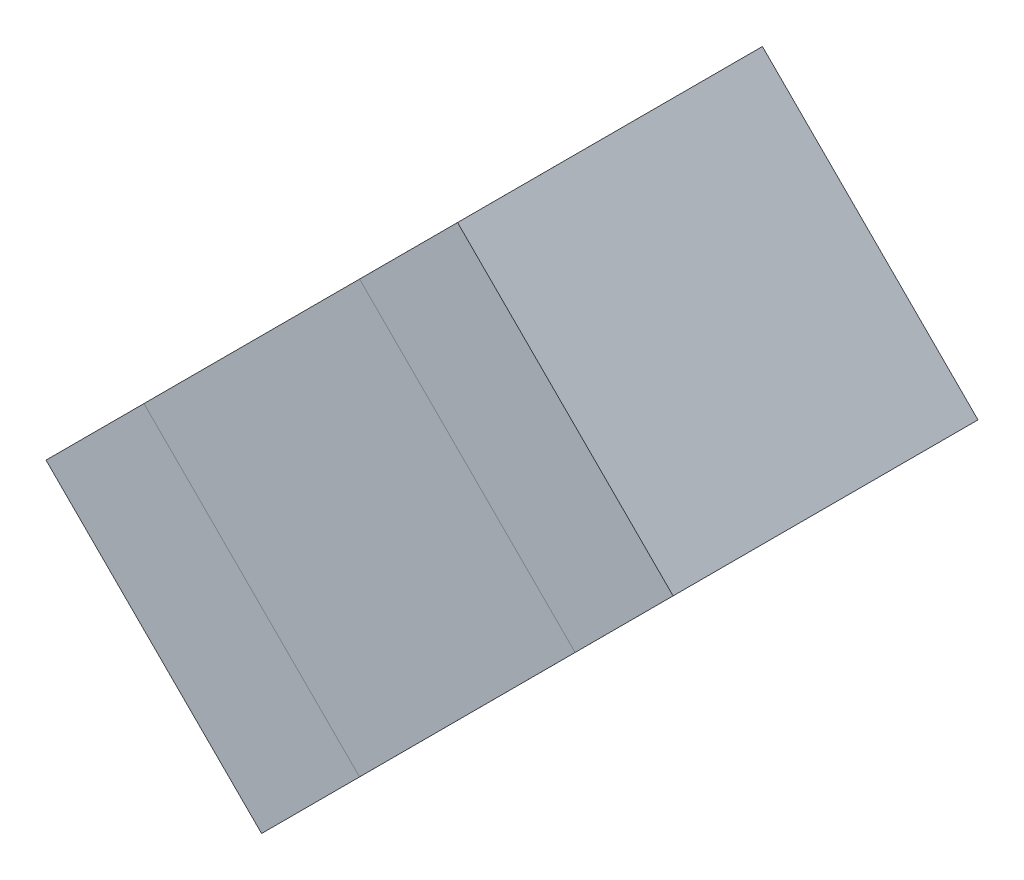
ISO-10303-21;
HEADER;
FILE_DESCRIPTION(('STEP AP214'),'2;1');
FILE_NAME('part.step','',(''),(''),'','','');
FILE_SCHEMA(('AUTOMOTIVE_DESIGN { 1 0 10303 214 1 1 1 1 }'));
ENDSEC;
DATA;
#1=APPLICATION_CONTEXT('core data for automotive mechanical design processes');
#2=APPLICATION_PROTOCOL_DEFINITION('international standard','automotive_design',2000,#1);
#3=PRODUCT_CONTEXT('',#1,'mechanical');
#4=PRODUCT('Part','Part','',(#3));
#5=PRODUCT_RELATED_PRODUCT_CATEGORY('part','',(#4));
#6=PRODUCT_DEFINITION_FORMATION('','',#4);
#7=PRODUCT_DEFINITION_CONTEXT('part definition',#1,'design');
#8=PRODUCT_DEFINITION('design','',#6,#7);
#9=PRODUCT_DEFINITION_SHAPE('','',#8);
#10=(LENGTH_UNIT() NAMED_UNIT(*) SI_UNIT(.MILLI.,.METRE.));
#11=(NAMED_UNIT(*) PLANE_ANGLE_UNIT() SI_UNIT($,.RADIAN.));
#12=(NAMED_UNIT(*) SI_UNIT($,.STERADIAN.) SOLID_ANGLE_UNIT());
#13=UNCERTAINTY_MEASURE_WITH_UNIT(LENGTH_MEASURE(1.E-05),#10,'distance_accuracy_value','');
#14=(GEOMETRIC_REPRESENTATION_CONTEXT(3) GLOBAL_UNCERTAINTY_ASSIGNED_CONTEXT((#13)) GLOBAL_UNIT_ASSIGNED_CONTEXT((#10,
#11,#12)) REPRESENTATION_CONTEXT('',''));
#15=CARTESIAN_POINT('',(0.,0.,0.));
#16=DIRECTION('',(0.,0.,1.));
#17=DIRECTION('',(1.,0.,0.));
#18=AXIS2_PLACEMENT_3D('',#15,#16,#17);
#19=CARTESIAN_POINT('',(2.544453153945,9.977800756445,0.32999934));
#20=DIRECTION('',(0.,0.,-1.));
#21=DIRECTION('',(0.,-1.,0.));
#22=AXIS2_PLACEMENT_3D('',#19,#20,#21);
#23=PLANE('',#22);
#24=DIRECTION('',(0.707106781186548,-0.707106781186548,0.));
#25=VECTOR('',#24,1.);
#26=CARTESIAN_POINT('',(2.544453153945,9.977800756445,0.32999934));
#27=LINE('',#26,#25);
#28=CARTESIAN_POINT('',(2.544453153945,9.977800756445,0.32999934));
#29=VERTEX_POINT('',#28);
#30=CARTESIAN_POINT('',(2.777800413945,9.744453496445,0.32999934));
#31=VERTEX_POINT('',#30);
#32=EDGE_CURVE('P0_E70',#29,#31,#27,.T.);
#33=ORIENTED_EDGE('',*,*,#32,.T.);
#34=DIRECTION('',(0.707106781186548,0.707106781186548,0.));
#35=VECTOR('',#34,1.);
#36=CARTESIAN_POINT('',(2.777800413945,9.744453496445,0.32999934));
#37=LINE('',#36,#35);
#38=CARTESIAN_POINT('',(2.883865733945,9.850518816445,0.32999934));
#39=VERTEX_POINT('',#38);
#40=EDGE_CURVE('P0_E21',#31,#39,#37,.T.);
#41=ORIENTED_EDGE('',*,*,#40,.T.);
#42=DIRECTION('',(-0.707106781186548,0.707106781186548,0.));
#43=VECTOR('',#42,1.);
#44=CARTESIAN_POINT('',(2.883865733945,9.850518816445,0.32999934));
#45=LINE('',#44,#43);
#46=CARTESIAN_POINT('',(2.650518473945,10.083866076445,0.32999934));
#47=VERTEX_POINT('',#46);
#48=EDGE_CURVE('P0_E56',#39,#47,#45,.T.);
#49=ORIENTED_EDGE('',*,*,#48,.T.);
#50=DIRECTION('',(-0.707106781187048,-0.707106781186048,0.));
#51=VECTOR('',#50,1.);
#52=CARTESIAN_POINT('',(2.650518473945,10.083866076445,0.32999934));
#53=LINE('',#52,#51);
#54=EDGE_CURVE('P0_E11',#47,#29,#53,.T.);
#55=ORIENTED_EDGE('',*,*,#54,.T.);
#56=EDGE_LOOP('',(#33,#41,#49,#55));
#57=FACE_BOUND('',#56,.T.);
#58=ADVANCED_FACE('P0_F17',(#57),#23,.F.);
#59=CARTESIAN_POINT('',(2.544453153945,9.977800756445,0.));
#60=DIRECTION('',(0.,0.,-1.));
#61=DIRECTION('',(0.,-1.,0.));
#62=AXIS2_PLACEMENT_3D('',#59,#60,#61);
#63=PLANE('',#62);
#64=DIRECTION('',(-0.707106781187048,-0.707106781186048,0.));
#65=VECTOR('',#64,1.);
#66=CARTESIAN_POINT('',(2.650518473945,10.083866076445,0.));
#67=LINE('',#66,#65);
#68=CARTESIAN_POINT('',(2.650518473945,10.083866076445,0.));
#69=VERTEX_POINT('',#68);
#70=CARTESIAN_POINT('',(2.544453153945,9.977800756445,0.));
#71=VERTEX_POINT('',#70);
#72=EDGE_CURVE('P0_E28',#69,#71,#67,.T.);
#73=ORIENTED_EDGE('',*,*,#72,.F.);
#74=DIRECTION('',(-0.707106781186548,0.707106781186548,0.));
#75=VECTOR('',#74,1.);
#76=CARTESIAN_POINT('',(2.883865733945,9.850518816445,0.));
#77=LINE('',#76,#75);
#78=CARTESIAN_POINT('',(2.883865733945,9.850518816445,0.));
#79=VERTEX_POINT('',#78);
#80=EDGE_CURVE('P0_E75',#79,#69,#77,.T.);
#81=ORIENTED_EDGE('',*,*,#80,.F.);
#82=DIRECTION('',(0.707106781186548,0.707106781186548,0.));
#83=VECTOR('',#82,1.);
#84=CARTESIAN_POINT('',(2.777800413945,9.744453496445,0.));
#85=LINE('',#84,#83);
#86=CARTESIAN_POINT('',(2.777800413945,9.744453496445,0.));
#87=VERTEX_POINT('',#86);
#88=EDGE_CURVE('P0_E78',#87,#79,#85,.T.);
#89=ORIENTED_EDGE('',*,*,#88,.F.);
#90=DIRECTION('',(0.707106781186548,-0.707106781186548,0.));
#91=VECTOR('',#90,1.);
#92=CARTESIAN_POINT('',(2.544453153945,9.977800756445,0.));
#93=LINE('',#92,#91);
#94=EDGE_CURVE('P0_E93',#71,#87,#93,.T.);
#95=ORIENTED_EDGE('',*,*,#94,.F.);
#96=EDGE_LOOP('',(#73,#81,#89,#95));
#97=FACE_BOUND('',#96,.T.);
#98=ADVANCED_FACE('P0_F19',(#97),#63,.T.);
#99=CARTESIAN_POINT('',(2.650518473945,10.083866076445,0.));
#100=DIRECTION('',(0.707106781186048,-0.707106781187048,0.));
#101=DIRECTION('',(0.,0.,-1.));
#102=AXIS2_PLACEMENT_3D('',#99,#100,#101);
#103=PLANE('',#102);
#104=ORIENTED_EDGE('',*,*,#72,.T.);
#105=DIRECTION('',(0.,0.,1.));
#106=VECTOR('',#105,1.);
#107=CARTESIAN_POINT('',(2.544453153945,9.977800756445,0.));
#108=LINE('',#107,#106);
#109=EDGE_CURVE('P0_E83',#71,#29,#108,.T.);
#110=ORIENTED_EDGE('',*,*,#109,.T.);
#111=ORIENTED_EDGE('',*,*,#54,.F.);
#112=DIRECTION('',(0.,0.,1.));
#113=VECTOR('',#112,1.);
#114=CARTESIAN_POINT('',(2.650518473945,10.083866076445,0.));
#115=LINE('',#114,#113);
#116=EDGE_CURVE('P0_E63',#69,#47,#115,.T.);
#117=ORIENTED_EDGE('',*,*,#116,.F.);
#118=EDGE_LOOP('',(#104,#110,#111,#117));
#119=FACE_BOUND('',#118,.T.);
#120=ADVANCED_FACE('P0_F106',(#119),#103,.F.);
#121=CARTESIAN_POINT('',(2.883865733945,9.850518816445,0.));
#122=DIRECTION('',(-0.707106781186548,-0.707106781186548,0.));
#123=DIRECTION('',(-0.707106781186548,0.707106781186548,0.));
#124=AXIS2_PLACEMENT_3D('',#121,#122,#123);
#125=PLANE('',#124);
#126=ORIENTED_EDGE('',*,*,#80,.T.);
#127=ORIENTED_EDGE('',*,*,#116,.T.);
#128=ORIENTED_EDGE('',*,*,#48,.F.);
#129=DIRECTION('',(0.,0.,1.));
#130=VECTOR('',#129,1.);
#131=CARTESIAN_POINT('',(2.883865733945,9.850518816445,0.));
#132=LINE('',#131,#130);
#133=EDGE_CURVE('P0_E61',#79,#39,#132,.T.);
#134=ORIENTED_EDGE('',*,*,#133,.F.);
#135=EDGE_LOOP('',(#126,#127,#128,#134));
#136=FACE_BOUND('',#135,.T.);
#137=ADVANCED_FACE('P0_F59',(#136),#125,.F.);
#138=CARTESIAN_POINT('',(2.777800413945,9.744453496445,0.));
#139=DIRECTION('',(-0.707106781186548,0.707106781186548,0.));
#140=DIRECTION('',(0.,0.,1.));
#141=AXIS2_PLACEMENT_3D('',#138,#139,#140);
#142=PLANE('',#141);
#143=ORIENTED_EDGE('',*,*,#88,.T.);
#144=ORIENTED_EDGE('',*,*,#133,.T.);
#145=ORIENTED_EDGE('',*,*,#40,.F.);
#146=DIRECTION('',(0.,0.,1.));
#147=VECTOR('',#146,1.);
#148=CARTESIAN_POINT('',(2.777800413945,9.744453496445,0.));
#149=LINE('',#148,#147);
#150=EDGE_CURVE('P0_E90',#87,#31,#149,.T.);
#151=ORIENTED_EDGE('',*,*,#150,.F.);
#152=EDGE_LOOP('',(#143,#144,#145,#151));
#153=FACE_BOUND('',#152,.T.);
#154=ADVANCED_FACE('P0_F76',(#153),#142,.F.);
#155=CARTESIAN_POINT('',(2.544453153945,9.977800756445,0.));
#156=DIRECTION('',(0.707106781186548,0.707106781186548,0.));
#157=DIRECTION('',(0.,0.,-1.));
#158=AXIS2_PLACEMENT_3D('',#155,#156,#157);
#159=PLANE('',#158);
#160=ORIENTED_EDGE('',*,*,#94,.T.);
#161=ORIENTED_EDGE('',*,*,#150,.T.);
#162=ORIENTED_EDGE('',*,*,#32,.F.);
#163=ORIENTED_EDGE('',*,*,#109,.F.);
#164=EDGE_LOOP('',(#160,#161,#162,#163));
#165=FACE_BOUND('',#164,.T.);
#166=ADVANCED_FACE('P0_F113',(#165),#159,.F.);
#167=CLOSED_SHELL('',(#58,#98,#120,#137,#154,#166));
#168=MANIFOLD_SOLID_BREP('P0_B1',#167);
#169=CARTESIAN_POINT('',(2.205051908828,9.638391881934,0.32999934));
#170=DIRECTION('',(0.,0.,-1.));
#171=DIRECTION('',(0.,-1.,0.));
#172=AXIS2_PLACEMENT_3D('',#169,#170,#171);
#173=PLANE('',#172);
#174=DIRECTION('',(0.707106781186548,-0.707106781186548,0.));
#175=VECTOR('',#174,1.);
#176=CARTESIAN_POINT('',(2.205051908828,9.638391881934,0.32999934));
#177=LINE('',#176,#175);
#178=CARTESIAN_POINT('',(2.205051908828,9.638391881934,0.32999934));
#179=VERTEX_POINT('',#178);
#180=CARTESIAN_POINT('',(2.438399168828,9.405044621934,0.32999934));
#181=VERTEX_POINT('',#180);
#182=EDGE_CURVE('P1_E81',#179,#181,#177,.T.);
#183=ORIENTED_EDGE('',*,*,#182,.T.);
#184=DIRECTION('',(0.707106781186548,0.707106781186548,0.));
#185=VECTOR('',#184,1.);
#186=CARTESIAN_POINT('',(2.438399168828,9.405044621934,0.32999934));
#187=LINE('',#186,#185);
#188=CARTESIAN_POINT('',(2.544464488828,9.511109941934,0.32999934));
#189=VERTEX_POINT('',#188);
#190=EDGE_CURVE('P1_E103',#181,#189,#187,.T.);
#191=ORIENTED_EDGE('',*,*,#190,.T.);
#192=DIRECTION('',(-0.707106781186548,0.707106781186548,0.));
#193=VECTOR('',#192,1.);
#194=CARTESIAN_POINT('',(2.544464488828,9.511109941934,0.32999934));
#195=LINE('',#194,#193);
#196=CARTESIAN_POINT('',(2.311117228828,9.744457201934,0.32999934));
#197=VERTEX_POINT('',#196);
#198=EDGE_CURVE('P1_E74',#189,#197,#195,.T.);
#199=ORIENTED_EDGE('',*,*,#198,.T.);
#200=DIRECTION('',(-0.707106781187048,-0.707106781186048,0.));
#201=VECTOR('',#200,1.);
#202=CARTESIAN_POINT('',(2.311117228828,9.744457201934,0.32999934));
#203=LINE('',#202,#201);
#204=EDGE_CURVE('P1_E11',#197,#179,#203,.T.);
#205=ORIENTED_EDGE('',*,*,#204,.T.);
#206=EDGE_LOOP('',(#183,#191,#199,#205));
#207=FACE_BOUND('',#206,.T.);
#208=ADVANCED_FACE('P1_F17',(#207),#173,.F.);
#209=CARTESIAN_POINT('',(2.205051908828,9.638391881934,0.));
#210=DIRECTION('',(0.,0.,-1.));
#211=DIRECTION('',(0.,-1.,0.));
#212=AXIS2_PLACEMENT_3D('',#209,#210,#211);
#213=PLANE('',#212);
#214=DIRECTION('',(-0.707106781187048,-0.707106781186048,0.));
#215=VECTOR('',#214,1.);
#216=CARTESIAN_POINT('',(2.311117228828,9.744457201934,0.));
#217=LINE('',#216,#215);
#218=CARTESIAN_POINT('',(2.311117228828,9.744457201934,0.));
#219=VERTEX_POINT('',#218);
#220=CARTESIAN_POINT('',(2.205051908828,9.638391881934,0.));
#221=VERTEX_POINT('',#220);
#222=EDGE_CURVE('P1_E20',#219,#221,#217,.T.);
#223=ORIENTED_EDGE('',*,*,#222,.F.);
#224=DIRECTION('',(-0.707106781186548,0.707106781186548,0.));
#225=VECTOR('',#224,1.);
#226=CARTESIAN_POINT('',(2.544464488828,9.511109941934,0.));
#227=LINE('',#226,#225);
#228=CARTESIAN_POINT('',(2.544464488828,9.511109941934,0.));
#229=VERTEX_POINT('',#228);
#230=EDGE_CURVE('P1_E104',#229,#219,#227,.T.);
#231=ORIENTED_EDGE('',*,*,#230,.F.);
#232=DIRECTION('',(0.707106781186548,0.707106781186548,0.));
#233=VECTOR('',#232,1.);
#234=CARTESIAN_POINT('',(2.438399168828,9.405044621934,0.));
#235=LINE('',#234,#233);
#236=CARTESIAN_POINT('',(2.438399168828,9.405044621934,0.));
#237=VERTEX_POINT('',#236);
#238=EDGE_CURVE('P1_E83',#237,#229,#235,.T.);
#239=ORIENTED_EDGE('',*,*,#238,.F.);
#240=DIRECTION('',(0.707106781186548,-0.707106781186548,0.));
#241=VECTOR('',#240,1.);
#242=CARTESIAN_POINT('',(2.205051908828,9.638391881934,0.));
#243=LINE('',#242,#241);
#244=EDGE_CURVE('P1_E79',#221,#237,#243,.T.);
#245=ORIENTED_EDGE('',*,*,#244,.F.);
#246=EDGE_LOOP('',(#223,#231,#239,#245));
#247=FACE_BOUND('',#246,.T.);
#248=ADVANCED_FACE('P1_F85',(#247),#213,.T.);
#249=CARTESIAN_POINT('',(2.311117228828,9.744457201934,0.));
#250=DIRECTION('',(0.707106781186048,-0.707106781187048,0.));
#251=DIRECTION('',(0.,0.,-1.));
#252=AXIS2_PLACEMENT_3D('',#249,#250,#251);
#253=PLANE('',#252);
#254=ORIENTED_EDGE('',*,*,#222,.T.);
#255=DIRECTION('',(0.,0.,1.));
#256=VECTOR('',#255,1.);
#257=CARTESIAN_POINT('',(2.205051908828,9.638391881934,0.));
#258=LINE('',#257,#256);
#259=EDGE_CURVE('P1_E68',#221,#179,#258,.T.);
#260=ORIENTED_EDGE('',*,*,#259,.T.);
#261=ORIENTED_EDGE('',*,*,#204,.F.);
#262=DIRECTION('',(0.,0.,1.));
#263=VECTOR('',#262,1.);
#264=CARTESIAN_POINT('',(2.311117228828,9.744457201934,0.));
#265=LINE('',#264,#263);
#266=EDGE_CURVE('P1_E71',#219,#197,#265,.T.);
#267=ORIENTED_EDGE('',*,*,#266,.F.);
#268=EDGE_LOOP('',(#254,#260,#261,#267));
#269=FACE_BOUND('',#268,.T.);
#270=ADVANCED_FACE('P1_F67',(#269),#253,.F.);
#271=CARTESIAN_POINT('',(2.544464488828,9.511109941934,0.));
#272=DIRECTION('',(-0.707106781186548,-0.707106781186548,0.));
#273=DIRECTION('',(-0.707106781186548,0.707106781186548,0.));
#274=AXIS2_PLACEMENT_3D('',#271,#272,#273);
#275=PLANE('',#274);
#276=ORIENTED_EDGE('',*,*,#230,.T.);
#277=ORIENTED_EDGE('',*,*,#266,.T.);
#278=ORIENTED_EDGE('',*,*,#198,.F.);
#279=DIRECTION('',(0.,0.,1.));
#280=VECTOR('',#279,1.);
#281=CARTESIAN_POINT('',(2.544464488828,9.511109941934,0.));
#282=LINE('',#281,#280);
#283=EDGE_CURVE('P1_E99',#229,#189,#282,.T.);
#284=ORIENTED_EDGE('',*,*,#283,.F.);
#285=EDGE_LOOP('',(#276,#277,#278,#284));
#286=FACE_BOUND('',#285,.T.);
#287=ADVANCED_FACE('P1_F117',(#286),#275,.F.);
#288=CARTESIAN_POINT('',(2.438399168828,9.405044621934,0.));
#289=DIRECTION('',(-0.707106781186548,0.707106781186548,0.));
#290=DIRECTION('',(0.,0.,1.));
#291=AXIS2_PLACEMENT_3D('',#288,#289,#290);
#292=PLANE('',#291);
#293=ORIENTED_EDGE('',*,*,#238,.T.);
#294=ORIENTED_EDGE('',*,*,#283,.T.);
#295=ORIENTED_EDGE('',*,*,#190,.F.);
#296=DIRECTION('',(0.,0.,1.));
#297=VECTOR('',#296,1.);
#298=CARTESIAN_POINT('',(2.438399168828,9.405044621934,0.));
#299=LINE('',#298,#297);
#300=EDGE_CURVE('P1_E89',#237,#181,#299,.T.);
#301=ORIENTED_EDGE('',*,*,#300,.F.);
#302=EDGE_LOOP('',(#293,#294,#295,#301));
#303=FACE_BOUND('',#302,.T.);
#304=ADVANCED_FACE('P1_F119',(#303),#292,.F.);
#305=CARTESIAN_POINT('',(2.205051908828,9.638391881934,0.));
#306=DIRECTION('',(0.707106781186548,0.707106781186548,0.));
#307=DIRECTION('',(0.,0.,-1.));
#308=AXIS2_PLACEMENT_3D('',#305,#306,#307);
#309=PLANE('',#308);
#310=ORIENTED_EDGE('',*,*,#244,.T.);
#311=ORIENTED_EDGE('',*,*,#300,.T.);
#312=ORIENTED_EDGE('',*,*,#182,.F.);
#313=ORIENTED_EDGE('',*,*,#259,.F.);
#314=EDGE_LOOP('',(#310,#311,#312,#313));
#315=FACE_BOUND('',#314,.T.);
#316=ADVANCED_FACE('P1_F77',(#315),#309,.F.);
#317=CLOSED_SHELL('',(#208,#248,#270,#287,#304,#316));
#318=MANIFOLD_SOLID_BREP('P1_B1',#317);
#319=CARTESIAN_POINT('',(2.311105201992,9.744460433887,0.32999934));
#320=DIRECTION('',(0.,0.,-1.));
#321=DIRECTION('',(0.,-1.,0.));
#322=AXIS2_PLACEMENT_3D('',#319,#320,#321);
#323=PLANE('',#322);
#324=DIRECTION('',(0.707106781186548,-0.707106781186548,0.));
#325=VECTOR('',#324,1.);
#326=CARTESIAN_POINT('',(2.311105201992,9.744460433887,0.32999934));
#327=LINE('',#326,#325);
#328=CARTESIAN_POINT('',(2.311105201992,9.744460433887,0.32999934));
#329=VERTEX_POINT('',#328);
#330=CARTESIAN_POINT('',(2.544452461992,9.511113173887,0.32999934));
#331=VERTEX_POINT('',#330);
#332=EDGE_CURVE('P2_E82',#329,#331,#327,.T.);
#333=ORIENTED_EDGE('',*,*,#332,.T.);
#334=DIRECTION('',(0.707106781186548,0.707106781186548,0.));
#335=VECTOR('',#334,1.);
#336=CARTESIAN_POINT('',(2.544452461992,9.511113173887,0.32999934));
#337=LINE('',#336,#335);
#338=CARTESIAN_POINT('',(2.777797181992,9.744457893887,0.32999934));
#339=VERTEX_POINT('',#338);
#340=EDGE_CURVE('P2_E103',#331,#339,#337,.T.);
#341=ORIENTED_EDGE('',*,*,#340,.T.);
#342=DIRECTION('',(-0.707106781186548,0.707106781186548,0.));
#343=VECTOR('',#342,1.);
#344=CARTESIAN_POINT('',(2.777797181992,9.744457893887,0.32999934));
#345=LINE('',#344,#343);
#346=CARTESIAN_POINT('',(2.544449921992,9.977805153887,0.32999934));
#347=VERTEX_POINT('',#346);
#348=EDGE_CURVE('P2_E75',#339,#347,#345,.T.);
#349=ORIENTED_EDGE('',*,*,#348,.T.);
#350=DIRECTION('',(-0.707106781186548,-0.707106781186548,0.));
#351=VECTOR('',#350,1.);
#352=CARTESIAN_POINT('',(2.544449921992,9.977805153887,0.32999934));
#353=LINE('',#352,#351);
#354=EDGE_CURVE('P2_E11',#347,#329,#353,.T.);
#355=ORIENTED_EDGE('',*,*,#354,.T.);
#356=EDGE_LOOP('',(#333,#341,#349,#355));
#357=FACE_BOUND('',#356,.T.);
#358=ADVANCED_FACE('P2_F17',(#357),#323,.F.);
#359=CARTESIAN_POINT('',(2.311105201992,9.744460433887,0.));
#360=DIRECTION('',(0.,0.,-1.));
#361=DIRECTION('',(0.,-1.,0.));
#362=AXIS2_PLACEMENT_3D('',#359,#360,#361);
#363=PLANE('',#362);
#364=DIRECTION('',(-0.707106781186548,-0.707106781186548,0.));
#365=VECTOR('',#364,1.);
#366=CARTESIAN_POINT('',(2.544449921992,9.977805153887,0.));
#367=LINE('',#366,#365);
#368=CARTESIAN_POINT('',(2.544449921992,9.977805153887,0.));
#369=VERTEX_POINT('',#368);
#370=CARTESIAN_POINT('',(2.311105201992,9.744460433887,0.));
#371=VERTEX_POINT('',#370);
#372=EDGE_CURVE('P2_E21',#369,#371,#367,.T.);
#373=ORIENTED_EDGE('',*,*,#372,.F.);
#374=DIRECTION('',(-0.707106781186548,0.707106781186548,0.));
#375=VECTOR('',#374,1.);
#376=CARTESIAN_POINT('',(2.777797181992,9.744457893887,0.));
#377=LINE('',#376,#375);
#378=CARTESIAN_POINT('',(2.777797181992,9.744457893887,0.));
#379=VERTEX_POINT('',#378);
#380=EDGE_CURVE('P2_E107',#379,#369,#377,.T.);
#381=ORIENTED_EDGE('',*,*,#380,.F.);
#382=DIRECTION('',(0.707106781186548,0.707106781186548,0.));
#383=VECTOR('',#382,1.);
#384=CARTESIAN_POINT('',(2.544452461992,9.511113173887,0.));
#385=LINE('',#384,#383);
#386=CARTESIAN_POINT('',(2.544452461992,9.511113173887,0.));
#387=VERTEX_POINT('',#386);
#388=EDGE_CURVE('P2_E84',#387,#379,#385,.T.);
#389=ORIENTED_EDGE('',*,*,#388,.F.);
#390=DIRECTION('',(0.707106781186548,-0.707106781186548,0.));
#391=VECTOR('',#390,1.);
#392=CARTESIAN_POINT('',(2.311105201992,9.744460433887,0.));
#393=LINE('',#392,#391);
#394=EDGE_CURVE('P2_E80',#371,#387,#393,.T.);
#395=ORIENTED_EDGE('',*,*,#394,.F.);
#396=EDGE_LOOP('',(#373,#381,#389,#395));
#397=FACE_BOUND('',#396,.T.);
#398=ADVANCED_FACE('P2_F19',(#397),#363,.T.);
#399=CARTESIAN_POINT('',(2.544449921992,9.977805153887,0.));
#400=DIRECTION('',(0.707106781186548,-0.707106781186548,0.));
#401=DIRECTION('',(0.,0.,-1.));
#402=AXIS2_PLACEMENT_3D('',#399,#400,#401);
#403=PLANE('',#402);
#404=ORIENTED_EDGE('',*,*,#372,.T.);
#405=DIRECTION('',(0.,0.,1.));
#406=VECTOR('',#405,1.);
#407=CARTESIAN_POINT('',(2.311105201992,9.744460433887,0.));
#408=LINE('',#407,#406);
#409=EDGE_CURVE('P2_E69',#371,#329,#408,.T.);
#410=ORIENTED_EDGE('',*,*,#409,.T.);
#411=ORIENTED_EDGE('',*,*,#354,.F.);
#412=DIRECTION('',(0.,0.,1.));
#413=VECTOR('',#412,1.);
#414=CARTESIAN_POINT('',(2.544449921992,9.977805153887,0.));
#415=LINE('',#414,#413);
#416=EDGE_CURVE('P2_E72',#369,#347,#415,.T.);
#417=ORIENTED_EDGE('',*,*,#416,.F.);
#418=EDGE_LOOP('',(#404,#410,#411,#417));
#419=FACE_BOUND('',#418,.T.);
#420=ADVANCED_FACE('P2_F68',(#419),#403,.F.);
#421=CARTESIAN_POINT('',(2.777797181992,9.744457893887,0.));
#422=DIRECTION('',(-0.707106781186548,-0.707106781186548,0.));
#423=DIRECTION('',(-0.707106781186548,0.707106781186548,0.));
#424=AXIS2_PLACEMENT_3D('',#421,#422,#423);
#425=PLANE('',#424);
#426=ORIENTED_EDGE('',*,*,#380,.T.);
#427=ORIENTED_EDGE('',*,*,#416,.T.);
#428=ORIENTED_EDGE('',*,*,#348,.F.);
#429=DIRECTION('',(0.,0.,1.));
#430=VECTOR('',#429,1.);
#431=CARTESIAN_POINT('',(2.777797181992,9.744457893887,0.));
#432=LINE('',#431,#430);
#433=EDGE_CURVE('P2_E99',#379,#339,#432,.T.);
#434=ORIENTED_EDGE('',*,*,#433,.F.);
#435=EDGE_LOOP('',(#426,#427,#428,#434));
#436=FACE_BOUND('',#435,.T.);
#437=ADVANCED_FACE('P2_F116',(#436),#425,.F.);
#438=CARTESIAN_POINT('',(2.544452461992,9.511113173887,0.));
#439=DIRECTION('',(-0.707106781186548,0.707106781186548,0.));
#440=DIRECTION('',(0.,0.,1.));
#441=AXIS2_PLACEMENT_3D('',#438,#439,#440);
#442=PLANE('',#441);
#443=ORIENTED_EDGE('',*,*,#388,.T.);
#444=ORIENTED_EDGE('',*,*,#433,.T.);
#445=ORIENTED_EDGE('',*,*,#340,.F.);
#446=DIRECTION('',(0.,0.,1.));
#447=VECTOR('',#446,1.);
#448=CARTESIAN_POINT('',(2.544452461992,9.511113173887,0.));
#449=LINE('',#448,#447);
#450=EDGE_CURVE('P2_E89',#387,#331,#449,.T.);
#451=ORIENTED_EDGE('',*,*,#450,.F.);
#452=EDGE_LOOP('',(#443,#444,#445,#451));
#453=FACE_BOUND('',#452,.T.);
#454=ADVANCED_FACE('P2_F118',(#453),#442,.F.);
#455=CARTESIAN_POINT('',(2.311105201992,9.744460433887,0.));
#456=DIRECTION('',(0.707106781186548,0.707106781186548,0.));
#457=DIRECTION('',(0.,0.,-1.));
#458=AXIS2_PLACEMENT_3D('',#455,#456,#457);
#459=PLANE('',#458);
#460=ORIENTED_EDGE('',*,*,#394,.T.);
#461=ORIENTED_EDGE('',*,*,#450,.T.);
#462=ORIENTED_EDGE('',*,*,#332,.F.);
#463=ORIENTED_EDGE('',*,*,#409,.F.);
#464=EDGE_LOOP('',(#460,#461,#462,#463));
#465=FACE_BOUND('',#464,.T.);
#466=ADVANCED_FACE('P2_F78',(#465),#459,.F.);
#467=CLOSED_SHELL('',(#358,#398,#420,#437,#454,#466));
#468=MANIFOLD_SOLID_BREP('P2_B1',#467);
#469=ADVANCED_BREP_SHAPE_REPRESENTATION('',(#18,#168,#318,#468),#14);
#470=SHAPE_DEFINITION_REPRESENTATION(#9,#469);
ENDSEC;
END-ISO-10303-21;
